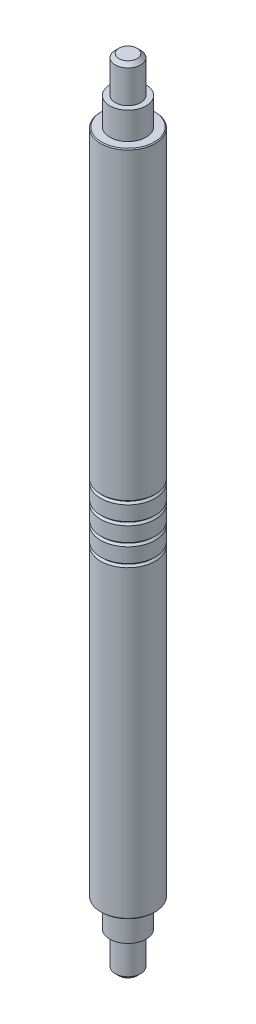
ISO-10303-21;
HEADER;
FILE_DESCRIPTION(('STEP AP214'),'2;1');
FILE_NAME('part.step','',(''),(''),'','','');
FILE_SCHEMA(('AUTOMOTIVE_DESIGN { 1 0 10303 214 1 1 1 1 }'));
ENDSEC;
DATA;
#1=APPLICATION_CONTEXT('core data for automotive mechanical design processes');
#2=APPLICATION_PROTOCOL_DEFINITION('international standard','automotive_design',2000,#1);
#3=PRODUCT_CONTEXT('',#1,'mechanical');
#4=PRODUCT('Part','Part','',(#3));
#5=PRODUCT_RELATED_PRODUCT_CATEGORY('part','',(#4));
#6=PRODUCT_DEFINITION_FORMATION('','',#4);
#7=PRODUCT_DEFINITION_CONTEXT('part definition',#1,'design');
#8=PRODUCT_DEFINITION('design','',#6,#7);
#9=PRODUCT_DEFINITION_SHAPE('','',#8);
#10=(LENGTH_UNIT() NAMED_UNIT(*) SI_UNIT(.MILLI.,.METRE.));
#11=(NAMED_UNIT(*) PLANE_ANGLE_UNIT() SI_UNIT($,.RADIAN.));
#12=(NAMED_UNIT(*) SI_UNIT($,.STERADIAN.) SOLID_ANGLE_UNIT());
#13=UNCERTAINTY_MEASURE_WITH_UNIT(LENGTH_MEASURE(1.E-05),#10,'distance_accuracy_value','');
#14=(GEOMETRIC_REPRESENTATION_CONTEXT(3) GLOBAL_UNCERTAINTY_ASSIGNED_CONTEXT((#13)) GLOBAL_UNIT_ASSIGNED_CONTEXT((#10,
#11,#12)) REPRESENTATION_CONTEXT('',''));
#15=CARTESIAN_POINT('',(0.,0.,0.));
#16=DIRECTION('',(0.,0.,1.));
#17=DIRECTION('',(1.,0.,0.));
#18=AXIS2_PLACEMENT_3D('',#15,#16,#17);
#19=CARTESIAN_POINT('',(0.,43.75,0.));
#20=DIRECTION('',(0.,-1.,0.));
#21=DIRECTION('',(0.,0.,-1.));
#22=AXIS2_PLACEMENT_3D('',#19,#20,#21);
#23=CYLINDRICAL_SURFACE('',#22,1.5);
#24=CARTESIAN_POINT('',(0.,20.475,0.));
#25=DIRECTION('',(0.,1.,0.));
#26=DIRECTION('',(0.,0.,1.));
#27=AXIS2_PLACEMENT_3D('',#24,#25,#26);
#28=CIRCLE('',#27,1.5);
#29=CARTESIAN_POINT('',(0.,20.475,1.5));
#30=VERTEX_POINT('',#29);
#31=EDGE_CURVE('E133',#30,#30,#28,.T.);
#32=ORIENTED_EDGE('',*,*,#31,.T.);
#33=EDGE_LOOP('',(#32));
#34=FACE_BOUND('',#33,.T.);
#35=CARTESIAN_POINT('',(0.,21.275,0.));
#36=DIRECTION('',(0.,1.,0.));
#37=DIRECTION('',(0.,0.,1.));
#38=AXIS2_PLACEMENT_3D('',#35,#36,#37);
#39=CIRCLE('',#38,1.5);
#40=CARTESIAN_POINT('',(0.,21.275,1.5));
#41=VERTEX_POINT('',#40);
#42=EDGE_CURVE('E130',#41,#41,#39,.T.);
#43=ORIENTED_EDGE('',*,*,#42,.F.);
#44=EDGE_LOOP('',(#43));
#45=FACE_BOUND('',#44,.T.);
#46=ADVANCED_FACE('F56',(#34,#45),#23,.T.);
#47=CARTESIAN_POINT('',(0.,21.475,0.));
#48=DIRECTION('',(0.,1.,0.));
#49=DIRECTION('',(0.,0.,1.));
#50=AXIS2_PLACEMENT_3D('',#47,#48,#49);
#51=CIRCLE('',#50,1.5);
#52=CARTESIAN_POINT('',(0.,21.475,1.5));
#53=VERTEX_POINT('',#52);
#54=EDGE_CURVE('E124',#53,#53,#51,.T.);
#55=ORIENTED_EDGE('',*,*,#54,.T.);
#56=EDGE_LOOP('',(#55));
#57=FACE_BOUND('',#56,.T.);
#58=CARTESIAN_POINT('',(0.,22.275,0.));
#59=DIRECTION('',(0.,1.,0.));
#60=DIRECTION('',(0.,0.,1.));
#61=AXIS2_PLACEMENT_3D('',#58,#59,#60);
#62=CIRCLE('',#61,1.5);
#63=CARTESIAN_POINT('',(0.,22.275,1.5));
#64=VERTEX_POINT('',#63);
#65=EDGE_CURVE('E121',#64,#64,#62,.T.);
#66=ORIENTED_EDGE('',*,*,#65,.F.);
#67=EDGE_LOOP('',(#66));
#68=FACE_BOUND('',#67,.T.);
#69=ADVANCED_FACE('F164',(#57,#68),#23,.T.);
#70=CARTESIAN_POINT('',(0.,22.475,0.));
#71=DIRECTION('',(0.,1.,0.));
#72=DIRECTION('',(0.,0.,1.));
#73=AXIS2_PLACEMENT_3D('',#70,#71,#72);
#74=CIRCLE('',#73,1.5);
#75=CARTESIAN_POINT('',(0.,22.475,1.5));
#76=VERTEX_POINT('',#75);
#77=EDGE_CURVE('E115',#76,#76,#74,.T.);
#78=ORIENTED_EDGE('',*,*,#77,.T.);
#79=EDGE_LOOP('',(#78));
#80=FACE_BOUND('',#79,.T.);
#81=CARTESIAN_POINT('',(0.,23.275,0.));
#82=DIRECTION('',(0.,1.,0.));
#83=DIRECTION('',(0.,0.,1.));
#84=AXIS2_PLACEMENT_3D('',#81,#82,#83);
#85=CIRCLE('',#84,1.5);
#86=CARTESIAN_POINT('',(0.,23.275,1.5));
#87=VERTEX_POINT('',#86);
#88=EDGE_CURVE('E112',#87,#87,#85,.T.);
#89=ORIENTED_EDGE('',*,*,#88,.F.);
#90=EDGE_LOOP('',(#89));
#91=FACE_BOUND('',#90,.T.);
#92=ADVANCED_FACE('F168',(#80,#91),#23,.T.);
#93=CARTESIAN_POINT('',(0.,40.2,0.));
#94=DIRECTION('',(0.,1.,0.));
#95=DIRECTION('',(0.,0.,1.));
#96=AXIS2_PLACEMENT_3D('',#93,#94,#95);
#97=CIRCLE('',#96,1.5);
#98=CARTESIAN_POINT('',(0.,40.2,1.5));
#99=VERTEX_POINT('',#98);
#100=EDGE_CURVE('E14',#99,#99,#97,.F.);
#101=ORIENTED_EDGE('',*,*,#100,.T.);
#102=EDGE_LOOP('',(#101));
#103=FACE_BOUND('',#102,.T.);
#104=CARTESIAN_POINT('',(0.,23.475,0.));
#105=DIRECTION('',(0.,1.,0.));
#106=DIRECTION('',(0.,0.,1.));
#107=AXIS2_PLACEMENT_3D('',#104,#105,#106);
#108=CIRCLE('',#107,1.5);
#109=CARTESIAN_POINT('',(0.,23.475,1.5));
#110=VERTEX_POINT('',#109);
#111=EDGE_CURVE('E106',#110,#110,#108,.T.);
#112=ORIENTED_EDGE('',*,*,#111,.T.);
#113=EDGE_LOOP('',(#112));
#114=FACE_BOUND('',#113,.T.);
#115=ADVANCED_FACE('F151',(#103,#114),#23,.T.);
#116=CARTESIAN_POINT('',(0.,40.25,0.));
#117=DIRECTION('',(0.,1.,0.));
#118=DIRECTION('',(0.,0.,1.));
#119=AXIS2_PLACEMENT_3D('',#116,#117,#118);
#120=CYLINDRICAL_SURFACE('',#119,1.);
#121=CARTESIAN_POINT('',(0.,40.25,0.));
#122=DIRECTION('',(0.,1.,0.));
#123=DIRECTION('',(0.,0.,1.));
#124=AXIS2_PLACEMENT_3D('',#121,#122,#123);
#125=CIRCLE('',#124,1.);
#126=CARTESIAN_POINT('',(0.,40.25,1.));
#127=VERTEX_POINT('',#126);
#128=EDGE_CURVE('E88',#127,#127,#125,.T.);
#129=ORIENTED_EDGE('',*,*,#128,.T.);
#130=EDGE_LOOP('',(#129));
#131=FACE_BOUND('',#130,.T.);
#132=CARTESIAN_POINT('',(0.,41.75,0.));
#133=DIRECTION('',(0.,1.,0.));
#134=DIRECTION('',(0.,0.,1.));
#135=AXIS2_PLACEMENT_3D('',#132,#133,#134);
#136=CIRCLE('',#135,1.);
#137=CARTESIAN_POINT('',(0.,41.75,1.));
#138=VERTEX_POINT('',#137);
#139=EDGE_CURVE('E94',#138,#138,#136,.F.);
#140=ORIENTED_EDGE('',*,*,#139,.T.);
#141=EDGE_LOOP('',(#140));
#142=FACE_BOUND('',#141,.T.);
#143=ADVANCED_FACE('F167',(#131,#142),#120,.T.);
#144=CARTESIAN_POINT('',(0.,40.25,0.));
#145=DIRECTION('',(0.,1.,0.));
#146=DIRECTION('',(0.,0.,1.));
#147=AXIS2_PLACEMENT_3D('',#144,#145,#146);
#148=PLANE('',#147);
#149=CARTESIAN_POINT('',(0.,40.25,0.));
#150=DIRECTION('',(0.,1.,0.));
#151=DIRECTION('',(0.,0.,1.));
#152=AXIS2_PLACEMENT_3D('',#149,#150,#151);
#153=CIRCLE('',#152,1.45000000000001);
#154=CARTESIAN_POINT('',(0.,40.25,1.45000000000001));
#155=VERTEX_POINT('',#154);
#156=EDGE_CURVE('E63',#155,#155,#153,.T.);
#157=ORIENTED_EDGE('',*,*,#156,.T.);
#158=EDGE_LOOP('',(#157));
#159=FACE_BOUND('',#158,.T.);
#160=ORIENTED_EDGE('',*,*,#128,.F.);
#161=EDGE_LOOP('',(#160));
#162=FACE_BOUND('',#161,.T.);
#163=ADVANCED_FACE('F173',(#159,#162),#148,.T.);
#164=CARTESIAN_POINT('',(0.,41.75,0.));
#165=DIRECTION('',(0.,1.,0.));
#166=DIRECTION('',(0.,0.,1.));
#167=AXIS2_PLACEMENT_3D('',#164,#165,#166);
#168=PLANE('',#167);
#169=ORIENTED_EDGE('',*,*,#139,.F.);
#170=EDGE_LOOP('',(#169));
#171=FACE_BOUND('',#170,.T.);
#172=CARTESIAN_POINT('',(0.,41.75,0.));
#173=DIRECTION('',(0.,1.,0.));
#174=DIRECTION('',(0.,0.,1.));
#175=AXIS2_PLACEMENT_3D('',#172,#173,#174);
#176=CIRCLE('',#175,0.7);
#177=CARTESIAN_POINT('',(0.,41.75,0.7));
#178=VERTEX_POINT('',#177);
#179=EDGE_CURVE('E97',#178,#178,#176,.T.);
#180=ORIENTED_EDGE('',*,*,#179,.F.);
#181=EDGE_LOOP('',(#180));
#182=FACE_BOUND('',#181,.T.);
#183=ADVANCED_FACE('F217',(#171,#182),#168,.T.);
#184=CARTESIAN_POINT('',(0.,41.75,0.));
#185=DIRECTION('',(0.,1.,0.));
#186=DIRECTION('',(0.,0.,1.));
#187=AXIS2_PLACEMENT_3D('',#184,#185,#186);
#188=CYLINDRICAL_SURFACE('',#187,0.7);
#189=CARTESIAN_POINT('',(0.,43.55,0.));
#190=DIRECTION('',(0.,1.,0.));
#191=DIRECTION('',(0.,0.,1.));
#192=AXIS2_PLACEMENT_3D('',#189,#190,#191);
#193=CIRCLE('',#192,0.7);
#194=CARTESIAN_POINT('',(0.,43.55,0.7));
#195=VERTEX_POINT('',#194);
#196=EDGE_CURVE('E82',#195,#195,#193,.F.);
#197=ORIENTED_EDGE('',*,*,#196,.T.);
#198=EDGE_LOOP('',(#197));
#199=FACE_BOUND('',#198,.T.);
#200=ORIENTED_EDGE('',*,*,#179,.T.);
#201=EDGE_LOOP('',(#200));
#202=FACE_BOUND('',#201,.T.);
#203=ADVANCED_FACE('F214',(#199,#202),#188,.T.);
#204=CARTESIAN_POINT('',(0.,43.75,0.));
#205=DIRECTION('',(0.,1.,0.));
#206=DIRECTION('',(0.,0.,1.));
#207=AXIS2_PLACEMENT_3D('',#204,#205,#206);
#208=PLANE('',#207);
#209=CARTESIAN_POINT('',(0.,43.75,0.));
#210=DIRECTION('',(0.,1.,0.));
#211=DIRECTION('',(0.,0.,1.));
#212=AXIS2_PLACEMENT_3D('',#209,#210,#211);
#213=CIRCLE('',#212,0.5);
#214=CARTESIAN_POINT('',(0.,43.75,0.5));
#215=VERTEX_POINT('',#214);
#216=EDGE_CURVE('E85',#215,#215,#213,.T.);
#217=ORIENTED_EDGE('',*,*,#216,.T.);
#218=EDGE_LOOP('',(#217));
#219=FACE_BOUND('',#218,.T.);
#220=ADVANCED_FACE('F184',(#219),#208,.T.);
#221=CARTESIAN_POINT('',(0.,23.375,0.));
#222=DIRECTION('',(0.,1.,0.));
#223=DIRECTION('',(0.,0.,1.));
#224=AXIS2_PLACEMENT_3D('',#221,#222,#223);
#225=CONICAL_SURFACE('',#224,1.4,0.785398163397452);
#226=ORIENTED_EDGE('',*,*,#111,.F.);
#227=EDGE_LOOP('',(#226));
#228=FACE_BOUND('',#227,.T.);
#229=CARTESIAN_POINT('',(0.,23.375,0.));
#230=DIRECTION('',(0.,1.,0.));
#231=DIRECTION('',(0.,0.,1.));
#232=AXIS2_PLACEMENT_3D('',#229,#230,#231);
#233=CIRCLE('',#232,1.4);
#234=CARTESIAN_POINT('',(0.,23.375,1.4));
#235=VERTEX_POINT('',#234);
#236=EDGE_CURVE('E109',#235,#235,#233,.T.);
#237=ORIENTED_EDGE('',*,*,#236,.T.);
#238=EDGE_LOOP('',(#237));
#239=FACE_BOUND('',#238,.T.);
#240=ADVANCED_FACE('F180',(#228,#239),#225,.T.);
#241=CARTESIAN_POINT('',(0.,23.275,0.));
#242=DIRECTION('',(0.,-1.,0.));
#243=DIRECTION('',(0.,0.,-1.));
#244=AXIS2_PLACEMENT_3D('',#241,#242,#243);
#245=CONICAL_SURFACE('',#244,1.5,0.78539816339745);
#246=ORIENTED_EDGE('',*,*,#236,.F.);
#247=EDGE_LOOP('',(#246));
#248=FACE_BOUND('',#247,.T.);
#249=ORIENTED_EDGE('',*,*,#88,.T.);
#250=EDGE_LOOP('',(#249));
#251=FACE_BOUND('',#250,.T.);
#252=ADVANCED_FACE('F183',(#248,#251),#245,.T.);
#253=CARTESIAN_POINT('',(0.,22.375,0.));
#254=DIRECTION('',(0.,1.,0.));
#255=DIRECTION('',(0.,0.,1.));
#256=AXIS2_PLACEMENT_3D('',#253,#254,#255);
#257=CONICAL_SURFACE('',#256,1.4,0.785398163397452);
#258=ORIENTED_EDGE('',*,*,#77,.F.);
#259=EDGE_LOOP('',(#258));
#260=FACE_BOUND('',#259,.T.);
#261=CARTESIAN_POINT('',(0.,22.375,0.));
#262=DIRECTION('',(0.,1.,0.));
#263=DIRECTION('',(0.,0.,1.));
#264=AXIS2_PLACEMENT_3D('',#261,#262,#263);
#265=CIRCLE('',#264,1.4);
#266=CARTESIAN_POINT('',(0.,22.375,1.4));
#267=VERTEX_POINT('',#266);
#268=EDGE_CURVE('E118',#267,#267,#265,.T.);
#269=ORIENTED_EDGE('',*,*,#268,.T.);
#270=EDGE_LOOP('',(#269));
#271=FACE_BOUND('',#270,.T.);
#272=ADVANCED_FACE('F190',(#260,#271),#257,.T.);
#273=CARTESIAN_POINT('',(0.,22.275,0.));
#274=DIRECTION('',(0.,-1.,0.));
#275=DIRECTION('',(0.,0.,-1.));
#276=AXIS2_PLACEMENT_3D('',#273,#274,#275);
#277=CONICAL_SURFACE('',#276,1.5,0.78539816339745);
#278=ORIENTED_EDGE('',*,*,#268,.F.);
#279=EDGE_LOOP('',(#278));
#280=FACE_BOUND('',#279,.T.);
#281=ORIENTED_EDGE('',*,*,#65,.T.);
#282=EDGE_LOOP('',(#281));
#283=FACE_BOUND('',#282,.T.);
#284=ADVANCED_FACE('F197',(#280,#283),#277,.T.);
#285=CARTESIAN_POINT('',(0.,21.375,0.));
#286=DIRECTION('',(0.,1.,0.));
#287=DIRECTION('',(0.,0.,1.));
#288=AXIS2_PLACEMENT_3D('',#285,#286,#287);
#289=CONICAL_SURFACE('',#288,1.4,0.785398163397452);
#290=ORIENTED_EDGE('',*,*,#54,.F.);
#291=EDGE_LOOP('',(#290));
#292=FACE_BOUND('',#291,.T.);
#293=CARTESIAN_POINT('',(0.,21.375,0.));
#294=DIRECTION('',(0.,1.,0.));
#295=DIRECTION('',(0.,0.,1.));
#296=AXIS2_PLACEMENT_3D('',#293,#294,#295);
#297=CIRCLE('',#296,1.4);
#298=CARTESIAN_POINT('',(0.,21.375,1.4));
#299=VERTEX_POINT('',#298);
#300=EDGE_CURVE('E127',#299,#299,#297,.T.);
#301=ORIENTED_EDGE('',*,*,#300,.T.);
#302=EDGE_LOOP('',(#301));
#303=FACE_BOUND('',#302,.T.);
#304=ADVANCED_FACE('F349',(#292,#303),#289,.T.);
#305=CARTESIAN_POINT('',(0.,21.275,0.));
#306=DIRECTION('',(0.,-1.,0.));
#307=DIRECTION('',(0.,0.,-1.));
#308=AXIS2_PLACEMENT_3D('',#305,#306,#307);
#309=CONICAL_SURFACE('',#308,1.5,0.78539816339745);
#310=ORIENTED_EDGE('',*,*,#300,.F.);
#311=EDGE_LOOP('',(#310));
#312=FACE_BOUND('',#311,.T.);
#313=ORIENTED_EDGE('',*,*,#42,.T.);
#314=EDGE_LOOP('',(#313));
#315=FACE_BOUND('',#314,.T.);
#316=ADVANCED_FACE('F339',(#312,#315),#309,.T.);
#317=CARTESIAN_POINT('',(0.,20.375,0.));
#318=DIRECTION('',(0.,1.,0.));
#319=DIRECTION('',(0.,0.,1.));
#320=AXIS2_PLACEMENT_3D('',#317,#318,#319);
#321=CONICAL_SURFACE('',#320,1.4,0.785398163397452);
#322=ORIENTED_EDGE('',*,*,#31,.F.);
#323=EDGE_LOOP('',(#322));
#324=FACE_BOUND('',#323,.T.);
#325=CARTESIAN_POINT('',(0.,20.375,0.));
#326=DIRECTION('',(0.,1.,0.));
#327=DIRECTION('',(0.,0.,1.));
#328=AXIS2_PLACEMENT_3D('',#325,#326,#327);
#329=CIRCLE('',#328,1.4);
#330=CARTESIAN_POINT('',(0.,20.375,1.4));
#331=VERTEX_POINT('',#330);
#332=EDGE_CURVE('E136',#331,#331,#329,.T.);
#333=ORIENTED_EDGE('',*,*,#332,.T.);
#334=EDGE_LOOP('',(#333));
#335=FACE_BOUND('',#334,.T.);
#336=ADVANCED_FACE('F231',(#324,#335),#321,.T.);
#337=CARTESIAN_POINT('',(0.,20.275,0.));
#338=DIRECTION('',(0.,-1.,0.));
#339=DIRECTION('',(0.,0.,-1.));
#340=AXIS2_PLACEMENT_3D('',#337,#338,#339);
#341=CONICAL_SURFACE('',#340,1.5,0.78539816339745);
#342=ORIENTED_EDGE('',*,*,#332,.F.);
#343=EDGE_LOOP('',(#342));
#344=FACE_BOUND('',#343,.T.);
#345=CARTESIAN_POINT('',(0.,20.275,0.));
#346=DIRECTION('',(0.,1.,0.));
#347=DIRECTION('',(0.,0.,1.));
#348=AXIS2_PLACEMENT_3D('',#345,#346,#347);
#349=CIRCLE('',#348,1.5);
#350=CARTESIAN_POINT('',(0.,20.275,1.5));
#351=VERTEX_POINT('',#350);
#352=EDGE_CURVE('E139',#351,#351,#349,.T.);
#353=ORIENTED_EDGE('',*,*,#352,.T.);
#354=EDGE_LOOP('',(#353));
#355=FACE_BOUND('',#354,.T.);
#356=ADVANCED_FACE('F143',(#344,#355),#341,.T.);
#357=CARTESIAN_POINT('',(0.,0.,0.));
#358=DIRECTION('',(0.,1.,0.));
#359=DIRECTION('',(0.,0.,1.));
#360=AXIS2_PLACEMENT_3D('',#357,#358,#359);
#361=PLANE('',#360);
#362=CARTESIAN_POINT('',(0.,0.,0.));
#363=DIRECTION('',(0.,1.,0.));
#364=DIRECTION('',(0.,0.,1.));
#365=AXIS2_PLACEMENT_3D('',#362,#363,#364);
#366=CIRCLE('',#365,0.5);
#367=CARTESIAN_POINT('',(0.,0.,0.5));
#368=VERTEX_POINT('',#367);
#369=EDGE_CURVE('E79',#368,#368,#366,.F.);
#370=ORIENTED_EDGE('',*,*,#369,.T.);
#371=EDGE_LOOP('',(#370));
#372=FACE_BOUND('',#371,.T.);
#373=ADVANCED_FACE('F206',(#372),#361,.F.);
#374=CARTESIAN_POINT('',(0.,7.88406204335659,0.));
#375=DIRECTION('',(0.,-1.,0.));
#376=DIRECTION('',(0.,0.,-1.));
#377=AXIS2_PLACEMENT_3D('',#374,#375,#376);
#378=CYLINDRICAL_SURFACE('',#377,0.7);
#379=CARTESIAN_POINT('',(0.,0.200000000000002,0.));
#380=DIRECTION('',(0.,1.,0.));
#381=DIRECTION('',(0.,0.,1.));
#382=AXIS2_PLACEMENT_3D('',#379,#380,#381);
#383=CIRCLE('',#382,0.7);
#384=CARTESIAN_POINT('',(0.,0.200000000000002,0.7));
#385=VERTEX_POINT('',#384);
#386=EDGE_CURVE('E76',#385,#385,#383,.T.);
#387=ORIENTED_EDGE('',*,*,#386,.T.);
#388=EDGE_LOOP('',(#387));
#389=FACE_BOUND('',#388,.T.);
#390=CARTESIAN_POINT('',(0.,2.,0.));
#391=DIRECTION('',(0.,1.,0.));
#392=DIRECTION('',(0.,0.,1.));
#393=AXIS2_PLACEMENT_3D('',#390,#391,#392);
#394=CIRCLE('',#393,0.7);
#395=CARTESIAN_POINT('',(0.,2.,0.7));
#396=VERTEX_POINT('',#395);
#397=EDGE_CURVE('E93',#396,#396,#394,.F.);
#398=ORIENTED_EDGE('',*,*,#397,.T.);
#399=EDGE_LOOP('',(#398));
#400=FACE_BOUND('',#399,.T.);
#401=ADVANCED_FACE('F202',(#389,#400),#378,.T.);
#402=CARTESIAN_POINT('',(0.,2.,0.));
#403=DIRECTION('',(0.,1.,0.));
#404=DIRECTION('',(0.,0.,1.));
#405=AXIS2_PLACEMENT_3D('',#402,#403,#404);
#406=PLANE('',#405);
#407=CARTESIAN_POINT('',(0.,1.99999999999999,0.));
#408=DIRECTION('',(0.,1.,0.));
#409=DIRECTION('',(0.,0.,1.));
#410=AXIS2_PLACEMENT_3D('',#407,#408,#409);
#411=CIRCLE('',#410,1.);
#412=CARTESIAN_POINT('',(0.,1.99999999999999,1.));
#413=VERTEX_POINT('',#412);
#414=EDGE_CURVE('E89',#413,#413,#411,.F.);
#415=ORIENTED_EDGE('',*,*,#414,.T.);
#416=EDGE_LOOP('',(#415));
#417=FACE_BOUND('',#416,.T.);
#418=ORIENTED_EDGE('',*,*,#397,.F.);
#419=EDGE_LOOP('',(#418));
#420=FACE_BOUND('',#419,.T.);
#421=ADVANCED_FACE('F205',(#417,#420),#406,.F.);
#422=CARTESIAN_POINT('',(0.,44.6340620433566,0.));
#423=DIRECTION('',(0.,-1.,0.));
#424=DIRECTION('',(0.,0.,-1.));
#425=AXIS2_PLACEMENT_3D('',#422,#423,#424);
#426=CYLINDRICAL_SURFACE('',#425,1.);
#427=ORIENTED_EDGE('',*,*,#414,.F.);
#428=EDGE_LOOP('',(#427));
#429=FACE_BOUND('',#428,.T.);
#430=CARTESIAN_POINT('',(0.,3.5,0.));
#431=DIRECTION('',(0.,1.,0.));
#432=DIRECTION('',(0.,0.,1.));
#433=AXIS2_PLACEMENT_3D('',#430,#431,#432);
#434=CIRCLE('',#433,1.);
#435=CARTESIAN_POINT('',(0.,3.5,1.));
#436=VERTEX_POINT('',#435);
#437=EDGE_CURVE('E92',#436,#436,#434,.F.);
#438=ORIENTED_EDGE('',*,*,#437,.T.);
#439=EDGE_LOOP('',(#438));
#440=FACE_BOUND('',#439,.T.);
#441=ADVANCED_FACE('F159',(#429,#440),#426,.T.);
#442=CARTESIAN_POINT('',(0.,3.5,0.));
#443=DIRECTION('',(0.,1.,0.));
#444=DIRECTION('',(0.,0.,1.));
#445=AXIS2_PLACEMENT_3D('',#442,#443,#444);
#446=PLANE('',#445);
#447=CARTESIAN_POINT('',(0.,3.5,0.));
#448=DIRECTION('',(0.,1.,0.));
#449=DIRECTION('',(0.,0.,1.));
#450=AXIS2_PLACEMENT_3D('',#447,#448,#449);
#451=CIRCLE('',#450,1.44999999999999);
#452=CARTESIAN_POINT('',(0.,3.5,1.44999999999999));
#453=VERTEX_POINT('',#452);
#454=EDGE_CURVE('E67',#453,#453,#451,.F.);
#455=ORIENTED_EDGE('',*,*,#454,.T.);
#456=EDGE_LOOP('',(#455));
#457=FACE_BOUND('',#456,.T.);
#458=ORIENTED_EDGE('',*,*,#437,.F.);
#459=EDGE_LOOP('',(#458));
#460=FACE_BOUND('',#459,.T.);
#461=ADVANCED_FACE('F148',(#457,#460),#446,.F.);
#462=CARTESIAN_POINT('',(0.,3.55000000000001,0.));
#463=DIRECTION('',(0.,1.,0.));
#464=DIRECTION('',(0.,0.,1.));
#465=AXIS2_PLACEMENT_3D('',#462,#463,#464);
#466=CIRCLE('',#465,1.5);
#467=CARTESIAN_POINT('',(0.,3.55000000000001,1.5));
#468=VERTEX_POINT('',#467);
#469=EDGE_CURVE('E71',#468,#468,#466,.T.);
#470=ORIENTED_EDGE('',*,*,#469,.T.);
#471=EDGE_LOOP('',(#470));
#472=FACE_BOUND('',#471,.T.);
#473=ORIENTED_EDGE('',*,*,#352,.F.);
#474=EDGE_LOOP('',(#473));
#475=FACE_BOUND('',#474,.T.);
#476=ADVANCED_FACE('F145',(#472,#475),#23,.T.);
#477=CARTESIAN_POINT('',(0.,43.75,0.));
#478=DIRECTION('',(0.,-1.,0.));
#479=DIRECTION('',(0.,0.,-1.));
#480=AXIS2_PLACEMENT_3D('',#477,#478,#479);
#481=CONICAL_SURFACE('',#480,0.5,0.78539816339745);
#482=ORIENTED_EDGE('',*,*,#196,.F.);
#483=EDGE_LOOP('',(#482));
#484=FACE_BOUND('',#483,.T.);
#485=ORIENTED_EDGE('',*,*,#216,.F.);
#486=EDGE_LOOP('',(#485));
#487=FACE_BOUND('',#486,.T.);
#488=ADVANCED_FACE('F147',(#484,#487),#481,.T.);
#489=CARTESIAN_POINT('',(0.,0.,0.));
#490=DIRECTION('',(0.,1.,0.));
#491=DIRECTION('',(0.,0.,1.));
#492=AXIS2_PLACEMENT_3D('',#489,#490,#491);
#493=CONICAL_SURFACE('',#492,0.5,0.785398163397442);
#494=ORIENTED_EDGE('',*,*,#386,.F.);
#495=EDGE_LOOP('',(#494));
#496=FACE_BOUND('',#495,.T.);
#497=ORIENTED_EDGE('',*,*,#369,.F.);
#498=EDGE_LOOP('',(#497));
#499=FACE_BOUND('',#498,.T.);
#500=ADVANCED_FACE('F156',(#496,#499),#493,.T.);
#501=CARTESIAN_POINT('',(0.,3.55000000000001,0.));
#502=DIRECTION('',(0.,1.,0.));
#503=DIRECTION('',(0.,0.,1.));
#504=AXIS2_PLACEMENT_3D('',#501,#502,#503);
#505=CONICAL_SURFACE('',#504,1.5,0.785398163397403);
#506=ORIENTED_EDGE('',*,*,#454,.F.);
#507=EDGE_LOOP('',(#506));
#508=FACE_BOUND('',#507,.T.);
#509=ORIENTED_EDGE('',*,*,#469,.F.);
#510=EDGE_LOOP('',(#509));
#511=FACE_BOUND('',#510,.T.);
#512=ADVANCED_FACE('F237',(#508,#511),#505,.T.);
#513=CARTESIAN_POINT('',(0.,40.25,0.));
#514=DIRECTION('',(0.,-1.,0.));
#515=DIRECTION('',(0.,0.,-1.));
#516=AXIS2_PLACEMENT_3D('',#513,#514,#515);
#517=CONICAL_SURFACE('',#516,1.45000000000001,0.785398163397474);
#518=ORIENTED_EDGE('',*,*,#100,.F.);
#519=EDGE_LOOP('',(#518));
#520=FACE_BOUND('',#519,.T.);
#521=ORIENTED_EDGE('',*,*,#156,.F.);
#522=EDGE_LOOP('',(#521));
#523=FACE_BOUND('',#522,.T.);
#524=ADVANCED_FACE('F58',(#520,#523),#517,.T.);
#525=CLOSED_SHELL('',(#46,#69,#92,#115,#143,#163,#183,#203,#220,#240,#252,#272,#284,#304,#316,
#336,#356,#373,#401,#421,#441,#461,#476,#488,#500,#512,#524));
#526=MANIFOLD_SOLID_BREP('B2',#525);
#527=ADVANCED_BREP_SHAPE_REPRESENTATION('',(#18,#526),#14);
#528=SHAPE_DEFINITION_REPRESENTATION(#9,#527);
ENDSEC;
END-ISO-10303-21;
